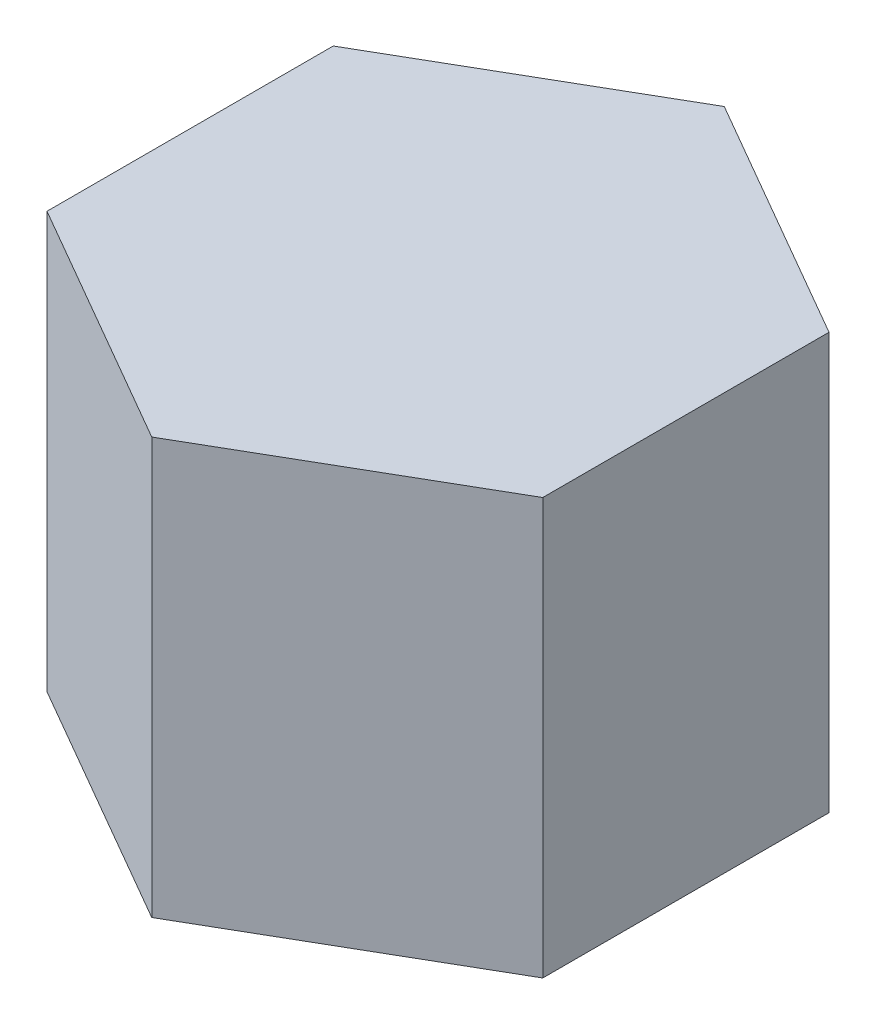
ISO-10303-21;
HEADER;
FILE_DESCRIPTION(('STEP AP214'),'2;1');
FILE_NAME('part.step','',(''),(''),'','','');
FILE_SCHEMA(('AUTOMOTIVE_DESIGN { 1 0 10303 214 1 1 1 1 }'));
ENDSEC;
DATA;
#1=APPLICATION_CONTEXT('core data for automotive mechanical design processes');
#2=APPLICATION_PROTOCOL_DEFINITION('international standard','automotive_design',2000,#1);
#3=PRODUCT_CONTEXT('',#1,'mechanical');
#4=PRODUCT('Part','Part','',(#3));
#5=PRODUCT_RELATED_PRODUCT_CATEGORY('part','',(#4));
#6=PRODUCT_DEFINITION_FORMATION('','',#4);
#7=PRODUCT_DEFINITION_CONTEXT('part definition',#1,'design');
#8=PRODUCT_DEFINITION('design','',#6,#7);
#9=PRODUCT_DEFINITION_SHAPE('','',#8);
#10=(LENGTH_UNIT() NAMED_UNIT(*) SI_UNIT(.MILLI.,.METRE.));
#11=(NAMED_UNIT(*) PLANE_ANGLE_UNIT() SI_UNIT($,.RADIAN.));
#12=(NAMED_UNIT(*) SI_UNIT($,.STERADIAN.) SOLID_ANGLE_UNIT());
#13=UNCERTAINTY_MEASURE_WITH_UNIT(LENGTH_MEASURE(1.E-05),#10,'distance_accuracy_value','');
#14=(GEOMETRIC_REPRESENTATION_CONTEXT(3) GLOBAL_UNCERTAINTY_ASSIGNED_CONTEXT((#13)) GLOBAL_UNIT_ASSIGNED_CONTEXT((#10,
#11,#12)) REPRESENTATION_CONTEXT('',''));
#15=CARTESIAN_POINT('',(0.,0.,0.));
#16=DIRECTION('',(0.,0.,1.));
#17=DIRECTION('',(1.,0.,0.));
#18=AXIS2_PLACEMENT_3D('',#15,#16,#17);
#19=CARTESIAN_POINT('',(202.339551417382,-147.556598747966,288.217869605357));
#20=DIRECTION('',(-0.499999999999943,0.,-0.866025403784471));
#21=DIRECTION('',(-0.866025403784471,0.,0.499999999999943));
#22=AXIS2_PLACEMENT_3D('',#19,#20,#21);
#23=PLANE('',#22);
#24=CARTESIAN_POINT('',(202.642660308706,-147.047793579175,288.042869605357));
#25=DIRECTION('',(-0.866025403784471,0.,0.499999999999943));
#26=VECTOR('',#25,1.);
#27=LINE('',#24,#26);
#28=CARTESIAN_POINT('',(202.642660308706,-147.047793579175,288.042869605357));
#29=VERTEX_POINT('',#28);
#30=CARTESIAN_POINT('',(202.339551417382,-147.047793579175,288.217869605357));
#31=VERTEX_POINT('',#30);
#32=EDGE_CURVE('E170',#29,#31,#27,.T.);
#33=ORIENTED_EDGE('',*,*,#32,.T.);
#34=CARTESIAN_POINT('',(202.339551417382,-147.556598747966,288.217869605357));
#35=DIRECTION('',(0.,1.,0.));
#36=VECTOR('',#35,1.);
#37=LINE('',#34,#36);
#38=CARTESIAN_POINT('',(202.339551417382,-147.556598747966,288.217869605357));
#39=VERTEX_POINT('',#38);
#40=EDGE_CURVE('E35',#39,#31,#37,.T.);
#41=ORIENTED_EDGE('',*,*,#40,.F.);
#42=CARTESIAN_POINT('',(202.642660308706,-147.556598747966,288.042869605357));
#43=DIRECTION('',(-0.866025403784471,0.,0.499999999999943));
#44=VECTOR('',#43,1.);
#45=LINE('',#42,#44);
#46=CARTESIAN_POINT('',(202.642660308706,-147.556598747966,288.042869605357));
#47=VERTEX_POINT('',#46);
#48=EDGE_CURVE('E159',#47,#39,#45,.T.);
#49=ORIENTED_EDGE('',*,*,#48,.F.);
#50=CARTESIAN_POINT('',(202.642660308706,-147.556598747966,288.042869605357));
#51=DIRECTION('',(0.,1.,0.));
#52=VECTOR('',#51,1.);
#53=LINE('',#50,#52);
#54=EDGE_CURVE('E10',#47,#29,#53,.T.);
#55=ORIENTED_EDGE('',*,*,#54,.T.);
#56=EDGE_LOOP('',(#33,#41,#49,#55));
#57=FACE_BOUND('',#56,.T.);
#58=ADVANCED_FACE('F16',(#57),#23,.F.);
#59=CARTESIAN_POINT('',(202.642660308706,-147.556598747966,291.594471220494));
#60=DIRECTION('',(-1.,0.,0.));
#61=DIRECTION('',(0.,-1.,0.));
#62=AXIS2_PLACEMENT_3D('',#59,#60,#61);
#63=PLANE('',#62);
#64=CARTESIAN_POINT('',(202.642660308706,-147.047793579175,287.692869605357));
#65=DIRECTION('',(0.,0.,1.));
#66=VECTOR('',#65,1.);
#67=LINE('',#64,#66);
#68=CARTESIAN_POINT('',(202.642660308706,-147.047793579175,287.692869605357));
#69=VERTEX_POINT('',#68);
#70=EDGE_CURVE('E167',#69,#29,#67,.T.);
#71=ORIENTED_EDGE('',*,*,#70,.T.);
#72=ORIENTED_EDGE('',*,*,#54,.F.);
#73=CARTESIAN_POINT('',(202.642660308706,-147.556598747966,287.692869605357));
#74=DIRECTION('',(0.,0.,1.));
#75=VECTOR('',#74,1.);
#76=LINE('',#73,#75);
#77=CARTESIAN_POINT('',(202.642660308706,-147.556598747966,287.692869605357));
#78=VERTEX_POINT('',#77);
#79=EDGE_CURVE('E156',#78,#47,#76,.T.);
#80=ORIENTED_EDGE('',*,*,#79,.F.);
#81=CARTESIAN_POINT('',(202.642660308706,-147.556598747966,287.692869605357));
#82=DIRECTION('',(0.,1.,0.));
#83=VECTOR('',#82,1.);
#84=LINE('',#81,#83);
#85=EDGE_CURVE('E27',#78,#69,#84,.T.);
#86=ORIENTED_EDGE('',*,*,#85,.T.);
#87=EDGE_LOOP('',(#71,#72,#80,#86));
#88=FACE_BOUND('',#87,.T.);
#89=ADVANCED_FACE('F189',(#88),#63,.F.);
#90=CARTESIAN_POINT('',(202.642660308706,-147.556598747966,287.692869605357));
#91=DIRECTION('',(-0.499999999999943,0.,0.866025403784471));
#92=DIRECTION('',(0.866025403784471,0.,0.499999999999943));
#93=AXIS2_PLACEMENT_3D('',#90,#91,#92);
#94=PLANE('',#93);
#95=CARTESIAN_POINT('',(202.339551417381,-147.047793579175,287.517869605357));
#96=DIRECTION('',(0.866025403784471,0.,0.499999999999943));
#97=VECTOR('',#96,1.);
#98=LINE('',#95,#97);
#99=CARTESIAN_POINT('',(202.339551417382,-147.047793579175,287.517869605357));
#100=VERTEX_POINT('',#99);
#101=EDGE_CURVE('E163',#100,#69,#98,.T.);
#102=ORIENTED_EDGE('',*,*,#101,.T.);
#103=ORIENTED_EDGE('',*,*,#85,.F.);
#104=CARTESIAN_POINT('',(202.339551417381,-147.556598747966,287.517869605357));
#105=DIRECTION('',(0.866025403784471,0.,0.499999999999943));
#106=VECTOR('',#105,1.);
#107=LINE('',#104,#106);
#108=CARTESIAN_POINT('',(202.339551417382,-147.556598747966,287.517869605357));
#109=VERTEX_POINT('',#108);
#110=EDGE_CURVE('E106',#109,#78,#107,.T.);
#111=ORIENTED_EDGE('',*,*,#110,.F.);
#112=CARTESIAN_POINT('',(202.339551417381,-147.556598747966,287.517869605357));
#113=DIRECTION('',(0.,1.,0.));
#114=VECTOR('',#113,1.);
#115=LINE('',#112,#114);
#116=EDGE_CURVE('E94',#109,#100,#115,.T.);
#117=ORIENTED_EDGE('',*,*,#116,.T.);
#118=EDGE_LOOP('',(#102,#103,#111,#117));
#119=FACE_BOUND('',#118,.T.);
#120=ADVANCED_FACE('F198',(#119),#94,.F.);
#121=CARTESIAN_POINT('',(202.339551417382,-147.556598747966,287.517869605357));
#122=DIRECTION('',(0.500000000000096,0.,0.866025403784383));
#123=DIRECTION('',(0.866025403784383,0.,-0.500000000000096));
#124=AXIS2_PLACEMENT_3D('',#121,#122,#123);
#125=PLANE('',#124);
#126=CARTESIAN_POINT('',(202.036442526057,-147.047793579175,287.692869605357));
#127=DIRECTION('',(0.866025403784383,0.,-0.500000000000096));
#128=VECTOR('',#127,1.);
#129=LINE('',#126,#128);
#130=CARTESIAN_POINT('',(202.036442526057,-147.047793579175,287.692869605357));
#131=VERTEX_POINT('',#130);
#132=EDGE_CURVE('E162',#131,#100,#129,.T.);
#133=ORIENTED_EDGE('',*,*,#132,.T.);
#134=ORIENTED_EDGE('',*,*,#116,.F.);
#135=CARTESIAN_POINT('',(202.036442526057,-147.556598747966,287.692869605357));
#136=DIRECTION('',(0.866025403784383,0.,-0.500000000000096));
#137=VECTOR('',#136,1.);
#138=LINE('',#135,#137);
#139=CARTESIAN_POINT('',(202.036442526057,-147.556598747966,287.692869605357));
#140=VERTEX_POINT('',#139);
#141=EDGE_CURVE('E98',#140,#109,#138,.T.);
#142=ORIENTED_EDGE('',*,*,#141,.F.);
#143=CARTESIAN_POINT('',(202.036442526057,-147.556598747966,287.692869605357));
#144=DIRECTION('',(0.,1.,0.));
#145=VECTOR('',#144,1.);
#146=LINE('',#143,#145);
#147=EDGE_CURVE('E79',#140,#131,#146,.T.);
#148=ORIENTED_EDGE('',*,*,#147,.T.);
#149=EDGE_LOOP('',(#133,#134,#142,#148));
#150=FACE_BOUND('',#149,.T.);
#151=ADVANCED_FACE('F100',(#150),#125,.F.);
#152=CARTESIAN_POINT('',(202.036442526057,-147.556598747966,291.594471220494));
#153=DIRECTION('',(1.,0.,0.));
#154=DIRECTION('',(0.,1.,0.));
#155=AXIS2_PLACEMENT_3D('',#152,#153,#154);
#156=PLANE('',#155);
#157=CARTESIAN_POINT('',(202.036442526057,-147.047793579175,288.042869605357));
#158=DIRECTION('',(0.,0.,-1.));
#159=VECTOR('',#158,1.);
#160=LINE('',#157,#159);
#161=CARTESIAN_POINT('',(202.036442526057,-147.047793579175,288.042869605357));
#162=VERTEX_POINT('',#161);
#163=EDGE_CURVE('E88',#162,#131,#160,.T.);
#164=ORIENTED_EDGE('',*,*,#163,.T.);
#165=ORIENTED_EDGE('',*,*,#147,.F.);
#166=CARTESIAN_POINT('',(202.036442526057,-147.556598747966,288.042869605357));
#167=DIRECTION('',(0.,0.,-1.));
#168=VECTOR('',#167,1.);
#169=LINE('',#166,#168);
#170=CARTESIAN_POINT('',(202.036442526057,-147.556598747966,288.042869605357));
#171=VERTEX_POINT('',#170);
#172=EDGE_CURVE('E84',#171,#140,#169,.T.);
#173=ORIENTED_EDGE('',*,*,#172,.F.);
#174=CARTESIAN_POINT('',(202.036442526057,-147.556598747966,288.042869605357));
#175=DIRECTION('',(0.,1.,0.));
#176=VECTOR('',#175,1.);
#177=LINE('',#174,#176);
#178=EDGE_CURVE('E58',#171,#162,#177,.T.);
#179=ORIENTED_EDGE('',*,*,#178,.T.);
#180=EDGE_LOOP('',(#164,#165,#173,#179));
#181=FACE_BOUND('',#180,.T.);
#182=ADVANCED_FACE('F82',(#181),#156,.F.);
#183=CARTESIAN_POINT('',(202.036442526057,-147.556598747966,288.042869605357));
#184=DIRECTION('',(0.499999999999943,0.,-0.866025403784471));
#185=DIRECTION('',(-0.866025403784471,0.,-0.499999999999943));
#186=AXIS2_PLACEMENT_3D('',#183,#184,#185);
#187=PLANE('',#186);
#188=CARTESIAN_POINT('',(202.339551417382,-147.047793579175,288.217869605357));
#189=DIRECTION('',(-0.866025403784471,0.,-0.499999999999943));
#190=VECTOR('',#189,1.);
#191=LINE('',#188,#190);
#192=EDGE_CURVE('E160',#31,#162,#191,.T.);
#193=ORIENTED_EDGE('',*,*,#192,.T.);
#194=ORIENTED_EDGE('',*,*,#178,.F.);
#195=CARTESIAN_POINT('',(202.339551417382,-147.556598747966,288.217869605357));
#196=DIRECTION('',(-0.866025403784471,0.,-0.499999999999943));
#197=VECTOR('',#196,1.);
#198=LINE('',#195,#197);
#199=EDGE_CURVE('E112',#39,#171,#198,.T.);
#200=ORIENTED_EDGE('',*,*,#199,.F.);
#201=ORIENTED_EDGE('',*,*,#40,.T.);
#202=EDGE_LOOP('',(#193,#194,#200,#201));
#203=FACE_BOUND('',#202,.T.);
#204=ADVANCED_FACE('F131',(#203),#187,.F.);
#205=CARTESIAN_POINT('',(206.491105863044,-147.556598747966,291.594471220494));
#206=DIRECTION('',(0.,1.,0.));
#207=DIRECTION('',(-1.,0.,0.));
#208=AXIS2_PLACEMENT_3D('',#205,#206,#207);
#209=PLANE('',#208);
#210=ORIENTED_EDGE('',*,*,#48,.T.);
#211=ORIENTED_EDGE('',*,*,#199,.T.);
#212=ORIENTED_EDGE('',*,*,#172,.T.);
#213=ORIENTED_EDGE('',*,*,#141,.T.);
#214=ORIENTED_EDGE('',*,*,#110,.T.);
#215=ORIENTED_EDGE('',*,*,#79,.T.);
#216=EDGE_LOOP('',(#210,#211,#212,#213,#214,#215));
#217=FACE_BOUND('',#216,.T.);
#218=ADVANCED_FACE('F111',(#217),#209,.F.);
#219=CARTESIAN_POINT('',(206.491105863044,-147.047793579175,291.594471220494));
#220=DIRECTION('',(0.,1.,0.));
#221=DIRECTION('',(-1.,0.,0.));
#222=AXIS2_PLACEMENT_3D('',#219,#220,#221);
#223=PLANE('',#222);
#224=ORIENTED_EDGE('',*,*,#32,.F.);
#225=ORIENTED_EDGE('',*,*,#70,.F.);
#226=ORIENTED_EDGE('',*,*,#101,.F.);
#227=ORIENTED_EDGE('',*,*,#132,.F.);
#228=ORIENTED_EDGE('',*,*,#163,.F.);
#229=ORIENTED_EDGE('',*,*,#192,.F.);
#230=EDGE_LOOP('',(#224,#225,#226,#227,#228,#229));
#231=FACE_BOUND('',#230,.T.);
#232=ADVANCED_FACE('F130',(#231),#223,.T.);
#233=CLOSED_SHELL('',(#58,#89,#120,#151,#182,#204,#218,#232));
#234=MANIFOLD_SOLID_BREP('B1',#233);
#235=ADVANCED_BREP_SHAPE_REPRESENTATION('',(#18,#234),#14);
#236=SHAPE_DEFINITION_REPRESENTATION(#9,#235);
ENDSEC;
END-ISO-10303-21;
